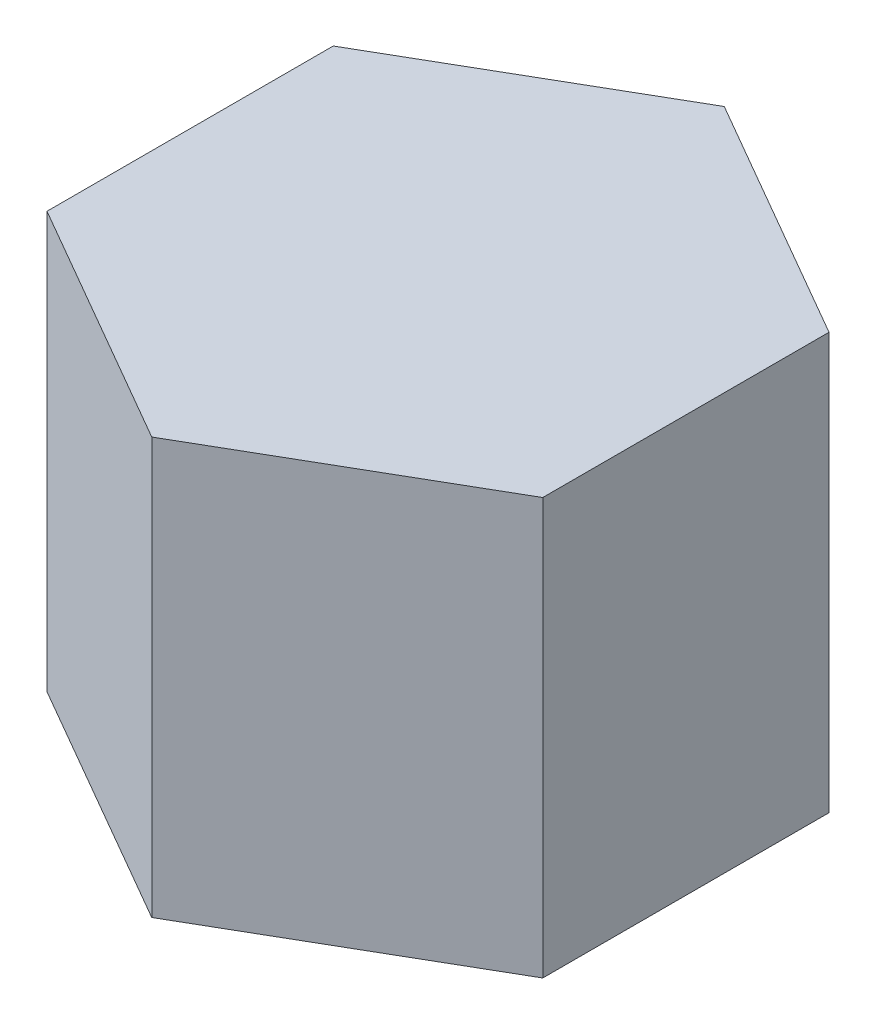
ISO-10303-21;
HEADER;
FILE_DESCRIPTION(('STEP AP214'),'2;1');
FILE_NAME('part.step','',(''),(''),'','','');
FILE_SCHEMA(('AUTOMOTIVE_DESIGN { 1 0 10303 214 1 1 1 1 }'));
ENDSEC;
DATA;
#1=APPLICATION_CONTEXT('core data for automotive mechanical design processes');
#2=APPLICATION_PROTOCOL_DEFINITION('international standard','automotive_design',2000,#1);
#3=PRODUCT_CONTEXT('',#1,'mechanical');
#4=PRODUCT('Part','Part','',(#3));
#5=PRODUCT_RELATED_PRODUCT_CATEGORY('part','',(#4));
#6=PRODUCT_DEFINITION_FORMATION('','',#4);
#7=PRODUCT_DEFINITION_CONTEXT('part definition',#1,'design');
#8=PRODUCT_DEFINITION('design','',#6,#7);
#9=PRODUCT_DEFINITION_SHAPE('','',#8);
#10=(LENGTH_UNIT() NAMED_UNIT(*) SI_UNIT(.MILLI.,.METRE.));
#11=(NAMED_UNIT(*) PLANE_ANGLE_UNIT() SI_UNIT($,.RADIAN.));
#12=(NAMED_UNIT(*) SI_UNIT($,.STERADIAN.) SOLID_ANGLE_UNIT());
#13=UNCERTAINTY_MEASURE_WITH_UNIT(LENGTH_MEASURE(1.E-05),#10,'distance_accuracy_value','');
#14=(GEOMETRIC_REPRESENTATION_CONTEXT(3) GLOBAL_UNCERTAINTY_ASSIGNED_CONTEXT((#13)) GLOBAL_UNIT_ASSIGNED_CONTEXT((#10,
#11,#12)) REPRESENTATION_CONTEXT('',''));
#15=CARTESIAN_POINT('',(0.,0.,0.));
#16=DIRECTION('',(0.,0.,1.));
#17=DIRECTION('',(1.,0.,0.));
#18=AXIS2_PLACEMENT_3D('',#15,#16,#17);
#19=CARTESIAN_POINT('',(210.339551417382,-147.556598747966,289.949920412926));
#20=DIRECTION('',(-0.499999999999978,0.,-0.866025403784452));
#21=DIRECTION('',(-0.866025403784452,0.,0.499999999999978));
#22=AXIS2_PLACEMENT_3D('',#19,#20,#21);
#23=PLANE('',#22);
#24=CARTESIAN_POINT('',(210.642660308706,-147.047793579175,289.774920412926));
#25=DIRECTION('',(-0.866025403784452,0.,0.499999999999978));
#26=VECTOR('',#25,1.);
#27=LINE('',#24,#26);
#28=CARTESIAN_POINT('',(210.642660308706,-147.047793579175,289.774920412926));
#29=VERTEX_POINT('',#28);
#30=CARTESIAN_POINT('',(210.339551417382,-147.047793579175,289.949920412926));
#31=VERTEX_POINT('',#30);
#32=EDGE_CURVE('E170',#29,#31,#27,.T.);
#33=ORIENTED_EDGE('',*,*,#32,.T.);
#34=CARTESIAN_POINT('',(210.339551417382,-147.556598747966,289.949920412926));
#35=DIRECTION('',(0.,1.,0.));
#36=VECTOR('',#35,1.);
#37=LINE('',#34,#36);
#38=CARTESIAN_POINT('',(210.339551417382,-147.556598747966,289.949920412926));
#39=VERTEX_POINT('',#38);
#40=EDGE_CURVE('E35',#39,#31,#37,.T.);
#41=ORIENTED_EDGE('',*,*,#40,.F.);
#42=CARTESIAN_POINT('',(210.642660308706,-147.556598747966,289.774920412926));
#43=DIRECTION('',(-0.866025403784452,0.,0.499999999999978));
#44=VECTOR('',#43,1.);
#45=LINE('',#42,#44);
#46=CARTESIAN_POINT('',(210.642660308706,-147.556598747966,289.774920412926));
#47=VERTEX_POINT('',#46);
#48=EDGE_CURVE('E159',#47,#39,#45,.T.);
#49=ORIENTED_EDGE('',*,*,#48,.F.);
#50=CARTESIAN_POINT('',(210.642660308706,-147.556598747966,289.774920412926));
#51=DIRECTION('',(0.,1.,0.));
#52=VECTOR('',#51,1.);
#53=LINE('',#50,#52);
#54=EDGE_CURVE('E10',#47,#29,#53,.T.);
#55=ORIENTED_EDGE('',*,*,#54,.T.);
#56=EDGE_LOOP('',(#33,#41,#49,#55));
#57=FACE_BOUND('',#56,.T.);
#58=ADVANCED_FACE('F16',(#57),#23,.F.);
#59=CARTESIAN_POINT('',(210.642660308706,-147.556598747966,291.594471220494));
#60=DIRECTION('',(-1.,0.,0.));
#61=DIRECTION('',(0.,-1.,0.));
#62=AXIS2_PLACEMENT_3D('',#59,#60,#61);
#63=PLANE('',#62);
#64=CARTESIAN_POINT('',(210.642660308706,-147.047793579175,289.424920412926));
#65=DIRECTION('',(0.,0.,1.));
#66=VECTOR('',#65,1.);
#67=LINE('',#64,#66);
#68=CARTESIAN_POINT('',(210.642660308706,-147.047793579175,289.424920412926));
#69=VERTEX_POINT('',#68);
#70=EDGE_CURVE('E167',#69,#29,#67,.T.);
#71=ORIENTED_EDGE('',*,*,#70,.T.);
#72=ORIENTED_EDGE('',*,*,#54,.F.);
#73=CARTESIAN_POINT('',(210.642660308706,-147.556598747966,289.424920412926));
#74=DIRECTION('',(0.,0.,1.));
#75=VECTOR('',#74,1.);
#76=LINE('',#73,#75);
#77=CARTESIAN_POINT('',(210.642660308706,-147.556598747966,289.424920412926));
#78=VERTEX_POINT('',#77);
#79=EDGE_CURVE('E156',#78,#47,#76,.T.);
#80=ORIENTED_EDGE('',*,*,#79,.F.);
#81=CARTESIAN_POINT('',(210.642660308706,-147.556598747966,289.424920412926));
#82=DIRECTION('',(0.,1.,0.));
#83=VECTOR('',#82,1.);
#84=LINE('',#81,#83);
#85=EDGE_CURVE('E27',#78,#69,#84,.T.);
#86=ORIENTED_EDGE('',*,*,#85,.T.);
#87=EDGE_LOOP('',(#71,#72,#80,#86));
#88=FACE_BOUND('',#87,.T.);
#89=ADVANCED_FACE('F189',(#88),#63,.F.);
#90=CARTESIAN_POINT('',(210.642660308706,-147.556598747966,289.424920412926));
#91=DIRECTION('',(-0.499999999999943,0.,0.866025403784471));
#92=DIRECTION('',(0.866025403784471,0.,0.499999999999943));
#93=AXIS2_PLACEMENT_3D('',#90,#91,#92);
#94=PLANE('',#93);
#95=CARTESIAN_POINT('',(210.339551417382,-147.047793579175,289.249920412926));
#96=DIRECTION('',(0.866025403784471,0.,0.499999999999943));
#97=VECTOR('',#96,1.);
#98=LINE('',#95,#97);
#99=CARTESIAN_POINT('',(210.339551417382,-147.047793579175,289.249920412926));
#100=VERTEX_POINT('',#99);
#101=EDGE_CURVE('E163',#100,#69,#98,.T.);
#102=ORIENTED_EDGE('',*,*,#101,.T.);
#103=ORIENTED_EDGE('',*,*,#85,.F.);
#104=CARTESIAN_POINT('',(210.339551417382,-147.556598747966,289.249920412926));
#105=DIRECTION('',(0.866025403784471,0.,0.499999999999943));
#106=VECTOR('',#105,1.);
#107=LINE('',#104,#106);
#108=CARTESIAN_POINT('',(210.339551417382,-147.556598747966,289.249920412926));
#109=VERTEX_POINT('',#108);
#110=EDGE_CURVE('E106',#109,#78,#107,.T.);
#111=ORIENTED_EDGE('',*,*,#110,.F.);
#112=CARTESIAN_POINT('',(210.339551417382,-147.556598747966,289.249920412926));
#113=DIRECTION('',(0.,1.,0.));
#114=VECTOR('',#113,1.);
#115=LINE('',#112,#114);
#116=EDGE_CURVE('E94',#109,#100,#115,.T.);
#117=ORIENTED_EDGE('',*,*,#116,.T.);
#118=EDGE_LOOP('',(#102,#103,#111,#117));
#119=FACE_BOUND('',#118,.T.);
#120=ADVANCED_FACE('F198',(#119),#94,.F.);
#121=CARTESIAN_POINT('',(210.339551417382,-147.556598747966,289.249920412926));
#122=DIRECTION('',(0.499999999999978,0.,0.866025403784452));
#123=DIRECTION('',(0.866025403784452,0.,-0.499999999999978));
#124=AXIS2_PLACEMENT_3D('',#121,#122,#123);
#125=PLANE('',#124);
#126=CARTESIAN_POINT('',(210.036442526057,-147.047793579175,289.424920412926));
#127=DIRECTION('',(0.866025403784452,0.,-0.499999999999978));
#128=VECTOR('',#127,1.);
#129=LINE('',#126,#128);
#130=CARTESIAN_POINT('',(210.036442526057,-147.047793579175,289.424920412926));
#131=VERTEX_POINT('',#130);
#132=EDGE_CURVE('E162',#131,#100,#129,.T.);
#133=ORIENTED_EDGE('',*,*,#132,.T.);
#134=ORIENTED_EDGE('',*,*,#116,.F.);
#135=CARTESIAN_POINT('',(210.036442526057,-147.556598747966,289.424920412926));
#136=DIRECTION('',(0.866025403784452,0.,-0.499999999999978));
#137=VECTOR('',#136,1.);
#138=LINE('',#135,#137);
#139=CARTESIAN_POINT('',(210.036442526057,-147.556598747966,289.424920412926));
#140=VERTEX_POINT('',#139);
#141=EDGE_CURVE('E98',#140,#109,#138,.T.);
#142=ORIENTED_EDGE('',*,*,#141,.F.);
#143=CARTESIAN_POINT('',(210.036442526057,-147.556598747966,289.424920412926));
#144=DIRECTION('',(0.,1.,0.));
#145=VECTOR('',#144,1.);
#146=LINE('',#143,#145);
#147=EDGE_CURVE('E79',#140,#131,#146,.T.);
#148=ORIENTED_EDGE('',*,*,#147,.T.);
#149=EDGE_LOOP('',(#133,#134,#142,#148));
#150=FACE_BOUND('',#149,.T.);
#151=ADVANCED_FACE('F100',(#150),#125,.F.);
#152=CARTESIAN_POINT('',(210.036442526057,-147.556598747966,291.594471220494));
#153=DIRECTION('',(1.,0.,0.));
#154=DIRECTION('',(0.,1.,0.));
#155=AXIS2_PLACEMENT_3D('',#152,#153,#154);
#156=PLANE('',#155);
#157=CARTESIAN_POINT('',(210.036442526057,-147.047793579175,289.774920412926));
#158=DIRECTION('',(0.,0.,-1.));
#159=VECTOR('',#158,1.);
#160=LINE('',#157,#159);
#161=CARTESIAN_POINT('',(210.036442526057,-147.047793579175,289.774920412926));
#162=VERTEX_POINT('',#161);
#163=EDGE_CURVE('E88',#162,#131,#160,.T.);
#164=ORIENTED_EDGE('',*,*,#163,.T.);
#165=ORIENTED_EDGE('',*,*,#147,.F.);
#166=CARTESIAN_POINT('',(210.036442526057,-147.556598747966,289.774920412926));
#167=DIRECTION('',(0.,0.,-1.));
#168=VECTOR('',#167,1.);
#169=LINE('',#166,#168);
#170=CARTESIAN_POINT('',(210.036442526057,-147.556598747966,289.774920412926));
#171=VERTEX_POINT('',#170);
#172=EDGE_CURVE('E84',#171,#140,#169,.T.);
#173=ORIENTED_EDGE('',*,*,#172,.F.);
#174=CARTESIAN_POINT('',(210.036442526057,-147.556598747966,289.774920412926));
#175=DIRECTION('',(0.,1.,0.));
#176=VECTOR('',#175,1.);
#177=LINE('',#174,#176);
#178=EDGE_CURVE('E58',#171,#162,#177,.T.);
#179=ORIENTED_EDGE('',*,*,#178,.T.);
#180=EDGE_LOOP('',(#164,#165,#173,#179));
#181=FACE_BOUND('',#180,.T.);
#182=ADVANCED_FACE('F82',(#181),#156,.F.);
#183=CARTESIAN_POINT('',(210.036442526057,-147.556598747966,289.774920412926));
#184=DIRECTION('',(0.499999999999943,0.,-0.866025403784471));
#185=DIRECTION('',(-0.866025403784471,0.,-0.499999999999943));
#186=AXIS2_PLACEMENT_3D('',#183,#184,#185);
#187=PLANE('',#186);
#188=CARTESIAN_POINT('',(210.339551417382,-147.047793579175,289.949920412926));
#189=DIRECTION('',(-0.866025403784471,0.,-0.499999999999943));
#190=VECTOR('',#189,1.);
#191=LINE('',#188,#190);
#192=EDGE_CURVE('E160',#31,#162,#191,.T.);
#193=ORIENTED_EDGE('',*,*,#192,.T.);
#194=ORIENTED_EDGE('',*,*,#178,.F.);
#195=CARTESIAN_POINT('',(210.339551417382,-147.556598747966,289.949920412926));
#196=DIRECTION('',(-0.866025403784471,0.,-0.499999999999943));
#197=VECTOR('',#196,1.);
#198=LINE('',#195,#197);
#199=EDGE_CURVE('E112',#39,#171,#198,.T.);
#200=ORIENTED_EDGE('',*,*,#199,.F.);
#201=ORIENTED_EDGE('',*,*,#40,.T.);
#202=EDGE_LOOP('',(#193,#194,#200,#201));
#203=FACE_BOUND('',#202,.T.);
#204=ADVANCED_FACE('F131',(#203),#187,.F.);
#205=CARTESIAN_POINT('',(206.491105863044,-147.556598747966,291.594471220494));
#206=DIRECTION('',(0.,1.,0.));
#207=DIRECTION('',(-1.,0.,0.));
#208=AXIS2_PLACEMENT_3D('',#205,#206,#207);
#209=PLANE('',#208);
#210=ORIENTED_EDGE('',*,*,#48,.T.);
#211=ORIENTED_EDGE('',*,*,#199,.T.);
#212=ORIENTED_EDGE('',*,*,#172,.T.);
#213=ORIENTED_EDGE('',*,*,#141,.T.);
#214=ORIENTED_EDGE('',*,*,#110,.T.);
#215=ORIENTED_EDGE('',*,*,#79,.T.);
#216=EDGE_LOOP('',(#210,#211,#212,#213,#214,#215));
#217=FACE_BOUND('',#216,.T.);
#218=ADVANCED_FACE('F111',(#217),#209,.F.);
#219=CARTESIAN_POINT('',(206.491105863044,-147.047793579175,291.594471220494));
#220=DIRECTION('',(0.,1.,0.));
#221=DIRECTION('',(-1.,0.,0.));
#222=AXIS2_PLACEMENT_3D('',#219,#220,#221);
#223=PLANE('',#222);
#224=ORIENTED_EDGE('',*,*,#32,.F.);
#225=ORIENTED_EDGE('',*,*,#70,.F.);
#226=ORIENTED_EDGE('',*,*,#101,.F.);
#227=ORIENTED_EDGE('',*,*,#132,.F.);
#228=ORIENTED_EDGE('',*,*,#163,.F.);
#229=ORIENTED_EDGE('',*,*,#192,.F.);
#230=EDGE_LOOP('',(#224,#225,#226,#227,#228,#229));
#231=FACE_BOUND('',#230,.T.);
#232=ADVANCED_FACE('F130',(#231),#223,.T.);
#233=CLOSED_SHELL('',(#58,#89,#120,#151,#182,#204,#218,#232));
#234=MANIFOLD_SOLID_BREP('B1',#233);
#235=ADVANCED_BREP_SHAPE_REPRESENTATION('',(#18,#234),#14);
#236=SHAPE_DEFINITION_REPRESENTATION(#9,#235);
ENDSEC;
END-ISO-10303-21;
